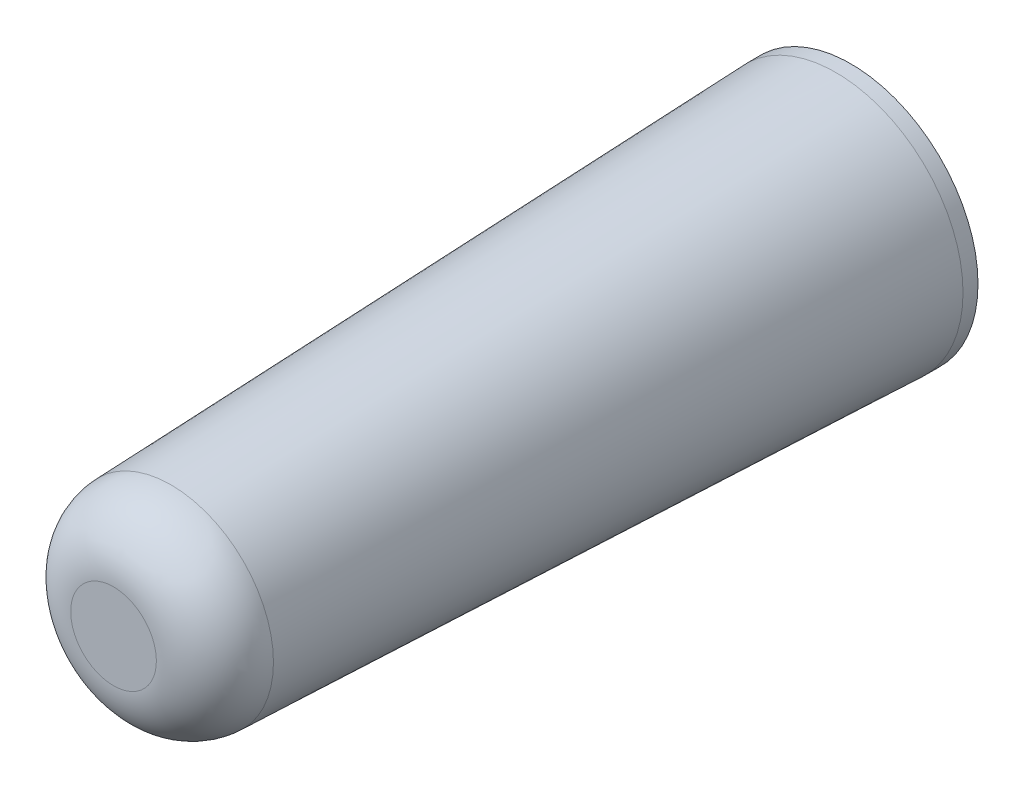
ISO-10303-21;
HEADER;
FILE_DESCRIPTION(('STEP AP214'),'2;1');
FILE_NAME('part.step','',(''),(''),'','','');
FILE_SCHEMA(('AUTOMOTIVE_DESIGN { 1 0 10303 214 1 1 1 1 }'));
ENDSEC;
DATA;
#1=APPLICATION_CONTEXT('core data for automotive mechanical design processes');
#2=APPLICATION_PROTOCOL_DEFINITION('international standard','automotive_design',2000,#1);
#3=PRODUCT_CONTEXT('',#1,'mechanical');
#4=PRODUCT('Part','Part','',(#3));
#5=PRODUCT_RELATED_PRODUCT_CATEGORY('part','',(#4));
#6=PRODUCT_DEFINITION_FORMATION('','',#4);
#7=PRODUCT_DEFINITION_CONTEXT('part definition',#1,'design');
#8=PRODUCT_DEFINITION('design','',#6,#7);
#9=PRODUCT_DEFINITION_SHAPE('','',#8);
#10=(LENGTH_UNIT() NAMED_UNIT(*) SI_UNIT(.MILLI.,.METRE.));
#11=(NAMED_UNIT(*) PLANE_ANGLE_UNIT() SI_UNIT($,.RADIAN.));
#12=(NAMED_UNIT(*) SI_UNIT($,.STERADIAN.) SOLID_ANGLE_UNIT());
#13=UNCERTAINTY_MEASURE_WITH_UNIT(LENGTH_MEASURE(1.E-05),#10,'distance_accuracy_value','');
#14=(GEOMETRIC_REPRESENTATION_CONTEXT(3) GLOBAL_UNCERTAINTY_ASSIGNED_CONTEXT((#13)) GLOBAL_UNIT_ASSIGNED_CONTEXT((#10,
#11,#12)) REPRESENTATION_CONTEXT('',''));
#15=CARTESIAN_POINT('',(0.,0.,0.));
#16=DIRECTION('',(0.,0.,1.));
#17=DIRECTION('',(1.,0.,0.));
#18=AXIS2_PLACEMENT_3D('',#15,#16,#17);
#19=CARTESIAN_POINT('',(0.,0.,7.6));
#20=DIRECTION('',(0.,0.,1.));
#21=DIRECTION('',(1.,0.,0.));
#22=AXIS2_PLACEMENT_3D('',#19,#20,#21);
#23=PLANE('',#22);
#24=CARTESIAN_POINT('',(0.,0.,7.6));
#25=DIRECTION('',(0.,0.,-1.));
#26=DIRECTION('',(-1.,0.,0.));
#27=AXIS2_PLACEMENT_3D('',#24,#25,#26);
#28=CIRCLE('',#27,2.9);
#29=CARTESIAN_POINT('',(2.9,0.,7.6));
#30=VERTEX_POINT('',#29);
#31=EDGE_CURVE('E11',#30,#30,#28,.T.);
#32=ORIENTED_EDGE('',*,*,#31,.F.);
#33=EDGE_LOOP('',(#32));
#34=FACE_BOUND('',#33,.T.);
#35=CARTESIAN_POINT('',(0.,0.,7.6));
#36=DIRECTION('',(0.,0.,1.));
#37=DIRECTION('',(-1.,0.,0.));
#38=AXIS2_PLACEMENT_3D('',#35,#36,#37);
#39=CIRCLE('',#38,4.75);
#40=CARTESIAN_POINT('',(4.75,0.,7.6));
#41=VERTEX_POINT('',#40);
#42=EDGE_CURVE('E79',#41,#41,#39,.T.);
#43=ORIENTED_EDGE('',*,*,#42,.F.);
#44=EDGE_LOOP('',(#43));
#45=FACE_BOUND('',#44,.T.);
#46=ADVANCED_FACE('F17',(#34,#45),#23,.F.);
#47=CARTESIAN_POINT('',(0.,0.,7.6));
#48=DIRECTION('',(0.,0.,1.));
#49=DIRECTION('',(-1.,0.,0.));
#50=AXIS2_PLACEMENT_3D('',#47,#48,#49);
#51=CYLINDRICAL_SURFACE('',#50,2.9);
#52=CARTESIAN_POINT('',(0.,0.,11.48));
#53=DIRECTION('',(0.,0.,-1.));
#54=DIRECTION('',(-1.,0.,0.));
#55=AXIS2_PLACEMENT_3D('',#52,#53,#54);
#56=CIRCLE('',#55,2.9);
#57=CARTESIAN_POINT('',(2.9,0.,11.48));
#58=VERTEX_POINT('',#57);
#59=EDGE_CURVE('E82',#58,#58,#56,.T.);
#60=ORIENTED_EDGE('',*,*,#59,.F.);
#61=DIRECTION('',(0.,0.,-1.));
#62=VECTOR('',#61,1.);
#63=CARTESIAN_POINT('',(2.9,0.,7.6));
#64=LINE('',#63,#62);
#65=EDGE_CURVE('E27',#58,#30,#64,.T.);
#66=ORIENTED_EDGE('',*,*,#65,.T.);
#67=ORIENTED_EDGE('',*,*,#31,.T.);
#68=ORIENTED_EDGE('',*,*,#65,.F.);
#69=EDGE_LOOP('',(#60,#66,#67,#68));
#70=FACE_BOUND('',#69,.T.);
#71=ADVANCED_FACE('F105',(#70),#51,.F.);
#72=CARTESIAN_POINT('',(0.,0.,11.48));
#73=DIRECTION('',(0.,0.,1.));
#74=DIRECTION('',(1.,0.,0.));
#75=AXIS2_PLACEMENT_3D('',#72,#73,#74);
#76=PLANE('',#75);
#77=ORIENTED_EDGE('',*,*,#59,.T.);
#78=EDGE_LOOP('',(#77));
#79=FACE_BOUND('',#78,.T.);
#80=ADVANCED_FACE('F112',(#79),#76,.F.);
#81=CARTESIAN_POINT('',(0.,0.,7.6));
#82=DIRECTION('',(0.,0.,1.));
#83=DIRECTION('',(-1.,0.,0.));
#84=AXIS2_PLACEMENT_3D('',#81,#82,#83);
#85=CYLINDRICAL_SURFACE('',#84,4.75);
#86=CARTESIAN_POINT('',(0.,0.,8.16));
#87=DIRECTION('',(0.,0.,1.));
#88=DIRECTION('',(-1.,0.,0.));
#89=AXIS2_PLACEMENT_3D('',#86,#87,#88);
#90=CIRCLE('',#89,4.75);
#91=CARTESIAN_POINT('',(4.75,0.,8.16));
#92=VERTEX_POINT('',#91);
#93=EDGE_CURVE('E74',#92,#92,#90,.T.);
#94=ORIENTED_EDGE('',*,*,#93,.F.);
#95=DIRECTION('',(0.,0.,-1.));
#96=VECTOR('',#95,1.);
#97=CARTESIAN_POINT('',(4.75,0.,7.6));
#98=LINE('',#97,#96);
#99=EDGE_CURVE('E83',#92,#41,#98,.T.);
#100=ORIENTED_EDGE('',*,*,#99,.T.);
#101=ORIENTED_EDGE('',*,*,#42,.T.);
#102=ORIENTED_EDGE('',*,*,#99,.F.);
#103=EDGE_LOOP('',(#94,#100,#101,#102));
#104=FACE_BOUND('',#103,.T.);
#105=ADVANCED_FACE('F101',(#104),#85,.T.);
#106=CARTESIAN_POINT('',(0.,0.,35.16));
#107=DIRECTION('',(0.,0.,1.));
#108=DIRECTION('',(1.,0.,0.));
#109=AXIS2_PLACEMENT_3D('',#106,#107,#108);
#110=PLANE('',#109);
#111=CARTESIAN_POINT('',(0.,0.,35.16));
#112=DIRECTION('',(0.,0.,-1.));
#113=DIRECTION('',(-1.,0.,0.));
#114=AXIS2_PLACEMENT_3D('',#111,#112,#113);
#115=CIRCLE('',#114,1.60106362429503);
#116=CARTESIAN_POINT('',(1.60106362429503,0.,35.16));
#117=VERTEX_POINT('',#116);
#118=EDGE_CURVE('E63',#117,#117,#115,.T.);
#119=ORIENTED_EDGE('',*,*,#118,.F.);
#120=EDGE_LOOP('',(#119));
#121=FACE_BOUND('',#120,.T.);
#122=ADVANCED_FACE('F19',(#121),#110,.T.);
#123=CARTESIAN_POINT('',(0.,0.,21.66));
#124=DIRECTION('',(0.,0.,-1.));
#125=DIRECTION('',(-1.,0.,0.));
#126=AXIS2_PLACEMENT_3D('',#123,#124,#125);
#127=CONICAL_SURFACE('',#126,4.25,0.0370201158739299);
#128=CARTESIAN_POINT('',(0.,0.,33.012536002937));
#129=DIRECTION('',(0.,0.,1.));
#130=DIRECTION('',(-1.,0.,0.));
#131=AXIS2_PLACEMENT_3D('',#128,#129,#130);
#132=CIRCLE('',#131,3.82953570359493);
#133=CARTESIAN_POINT('',(3.82953570359493,0.,33.012536002937));
#134=VERTEX_POINT('',#133);
#135=EDGE_CURVE('E76',#134,#134,#132,.T.);
#136=ORIENTED_EDGE('',*,*,#135,.F.);
#137=DIRECTION('',(0.0370116605098803,0.,-0.999314833766767));
#138=VECTOR('',#137,1.);
#139=CARTESIAN_POINT('',(4.25,0.,21.66));
#140=LINE('',#139,#138);
#141=EDGE_CURVE('E54',#134,#92,#140,.T.);
#142=ORIENTED_EDGE('',*,*,#141,.T.);
#143=ORIENTED_EDGE('',*,*,#93,.T.);
#144=ORIENTED_EDGE('',*,*,#141,.F.);
#145=EDGE_LOOP('',(#136,#142,#143,#144));
#146=FACE_BOUND('',#145,.T.);
#147=ADVANCED_FACE('F99',(#146),#127,.T.);
#148=CARTESIAN_POINT('',(1.60106362429503,0.,35.16));
#149=CARTESIAN_POINT('',(1.60106362429503,-1.60106362429503,35.16));
#150=CARTESIAN_POINT('',(0.,-1.60106362429503,35.16));
#151=CARTESIAN_POINT('',(-1.60106362429503,-1.60106362429503,35.16));
#152=CARTESIAN_POINT('',(-1.60106362429503,0.,35.16));
#153=CARTESIAN_POINT('',(-1.60106362429503,1.60106362429503,35.16));
#154=CARTESIAN_POINT('',(0.,1.60106362429503,35.16));
#155=CARTESIAN_POINT('',(1.60106362429503,1.60106362429503,35.16));
#156=CARTESIAN_POINT('',(1.60106362429503,0.,35.16));
#157=CARTESIAN_POINT('',(3.75,0.,35.16));
#158=CARTESIAN_POINT('',(3.75,-3.75,35.16));
#159=CARTESIAN_POINT('',(0.,-3.75,35.16));
#160=CARTESIAN_POINT('',(-3.75,-3.75,35.16));
#161=CARTESIAN_POINT('',(-3.75,0.,35.16));
#162=CARTESIAN_POINT('',(-3.75,3.75,35.16));
#163=CARTESIAN_POINT('',(0.,3.75,35.16));
#164=CARTESIAN_POINT('',(3.75,3.75,35.16));
#165=CARTESIAN_POINT('',(3.75,0.,35.16));
#166=CARTESIAN_POINT('',(3.82953570359493,0.,33.012536002937));
#167=CARTESIAN_POINT('',(3.82953570359492,-3.82953570359492,33.012536002937));
#168=CARTESIAN_POINT('',(0.,-3.82953570359493,33.012536002937));
#169=CARTESIAN_POINT('',(-3.82953570359492,-3.82953570359492,33.012536002937));
#170=CARTESIAN_POINT('',(-3.82953570359493,0.,33.012536002937));
#171=CARTESIAN_POINT('',(-3.82953570359492,3.82953570359492,33.012536002937));
#172=CARTESIAN_POINT('',(0.,3.82953570359493,33.012536002937));
#173=CARTESIAN_POINT('',(3.82953570359492,3.82953570359492,33.012536002937));
#174=CARTESIAN_POINT('',(3.82953570359493,0.,33.012536002937));
#175=(BOUNDED_SURFACE() B_SPLINE_SURFACE(2,2,((#148,#149,#150,#151,#152,#153,#154,#155,#156),
(#157,#158,#159,#160,#161,#162,#163,#164,#165),(#166,#167,#168,#169,#170,#171,#172,#173,#174)),
.UNSPECIFIED.,.F.,.T.,.F.) B_SPLINE_SURFACE_WITH_KNOTS((3,3),(3,2,2,2,3),(-1.5707963267949,
-0.0370201158739288),(-3.14159265358979,-1.5707963267949,0.,1.5707963267949,3.14159265358979),
.UNSPECIFIED.) GEOMETRIC_REPRESENTATION_ITEM() RATIONAL_B_SPLINE_SURFACE(((1.,0.707106781186548,
1.,0.707106781186548,1.,0.707106781186548,1.,0.707106781186548,1.),(0.720073489482111,
0.509168847365461,0.720073489482111,0.509168847365461,0.720073489482111,0.509168847365461,
0.720073489482111,0.509168847365461,0.720073489482111),(1.,0.707106781186548,1.,
0.707106781186548,1.,0.707106781186548,1.,0.707106781186548,1.))) REPRESENTATION_ITEM('') SURFACE());
#176=CARTESIAN_POINT('',(1.60106362429503,0.,32.93));
#177=DIRECTION('',(0.,-1.,0.));
#178=DIRECTION('',(1.,0.,0.));
#179=AXIS2_PLACEMENT_3D('',#176,#177,#178);
#180=CIRCLE('',#179,2.23);
#181=EDGE_CURVE('E66',#134,#117,#180,.T.);
#182=ORIENTED_EDGE('',*,*,#135,.T.);
#183=ORIENTED_EDGE('',*,*,#181,.T.);
#184=ORIENTED_EDGE('',*,*,#118,.T.);
#185=ORIENTED_EDGE('',*,*,#181,.F.);
#186=EDGE_LOOP('',(#182,#183,#184,#185));
#187=FACE_BOUND('',#186,.T.);
#188=ADVANCED_FACE('F65',(#187),#175,.F.);
#189=CLOSED_SHELL('',(#46,#71,#80,#105,#122,#147,#188));
#190=MANIFOLD_SOLID_BREP('B1',#189);
#191=ADVANCED_BREP_SHAPE_REPRESENTATION('',(#18,#190),#14);
#192=SHAPE_DEFINITION_REPRESENTATION(#9,#191);
ENDSEC;
END-ISO-10303-21;
